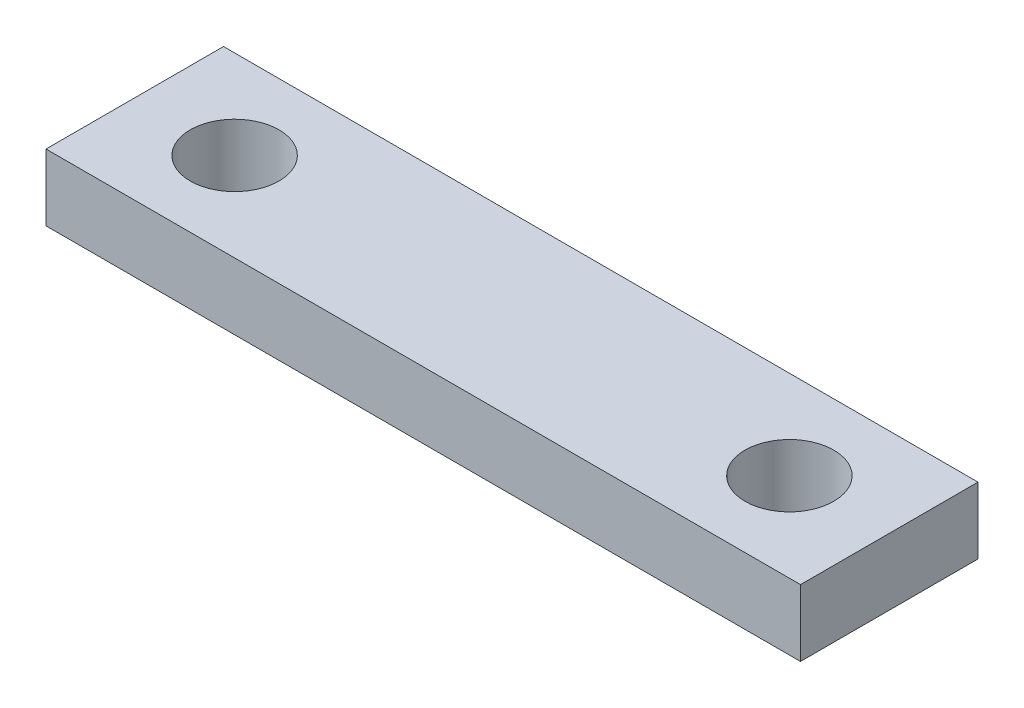
ISO-10303-21;
HEADER;
FILE_DESCRIPTION(('STEP AP214'),'2;1');
FILE_NAME('part.step','',(''),(''),'','','');
FILE_SCHEMA(('AUTOMOTIVE_DESIGN { 1 0 10303 214 1 1 1 1 }'));
ENDSEC;
DATA;
#1=APPLICATION_CONTEXT('core data for automotive mechanical design processes');
#2=APPLICATION_PROTOCOL_DEFINITION('international standard','automotive_design',2000,#1);
#3=PRODUCT_CONTEXT('',#1,'mechanical');
#4=PRODUCT('Part','Part','',(#3));
#5=PRODUCT_RELATED_PRODUCT_CATEGORY('part','',(#4));
#6=PRODUCT_DEFINITION_FORMATION('','',#4);
#7=PRODUCT_DEFINITION_CONTEXT('part definition',#1,'design');
#8=PRODUCT_DEFINITION('design','',#6,#7);
#9=PRODUCT_DEFINITION_SHAPE('','',#8);
#10=(LENGTH_UNIT() NAMED_UNIT(*) SI_UNIT(.MILLI.,.METRE.));
#11=(NAMED_UNIT(*) PLANE_ANGLE_UNIT() SI_UNIT($,.RADIAN.));
#12=(NAMED_UNIT(*) SI_UNIT($,.STERADIAN.) SOLID_ANGLE_UNIT());
#13=UNCERTAINTY_MEASURE_WITH_UNIT(LENGTH_MEASURE(1.E-05),#10,'distance_accuracy_value','');
#14=(GEOMETRIC_REPRESENTATION_CONTEXT(3) GLOBAL_UNCERTAINTY_ASSIGNED_CONTEXT((#13)) GLOBAL_UNIT_ASSIGNED_CONTEXT((#10,
#11,#12)) REPRESENTATION_CONTEXT('',''));
#15=CARTESIAN_POINT('',(0.,0.,0.));
#16=DIRECTION('',(0.,0.,1.));
#17=DIRECTION('',(1.,0.,0.));
#18=AXIS2_PLACEMENT_3D('',#15,#16,#17);
#19=CARTESIAN_POINT('',(0.,3.,0.));
#20=DIRECTION('',(0.,-1.,0.));
#21=DIRECTION('',(0.,0.,-1.));
#22=AXIS2_PLACEMENT_3D('',#19,#20,#21);
#23=PLANE('',#22);
#24=DIRECTION('',(0.,0.,-1.));
#25=VECTOR('',#24,1.);
#26=CARTESIAN_POINT('',(17.,3.,4.));
#27=LINE('',#26,#25);
#28=CARTESIAN_POINT('',(17.,3.,4.));
#29=VERTEX_POINT('',#28);
#30=CARTESIAN_POINT('',(17.,3.,-4.));
#31=VERTEX_POINT('',#30);
#32=EDGE_CURVE('E89',#29,#31,#27,.T.);
#33=ORIENTED_EDGE('',*,*,#32,.T.);
#34=DIRECTION('',(-1.,0.,0.));
#35=VECTOR('',#34,1.);
#36=CARTESIAN_POINT('',(-17.,3.,-4.));
#37=LINE('',#36,#35);
#38=CARTESIAN_POINT('',(-17.,3.,-4.));
#39=VERTEX_POINT('',#38);
#40=EDGE_CURVE('E84',#31,#39,#37,.T.);
#41=ORIENTED_EDGE('',*,*,#40,.T.);
#42=DIRECTION('',(0.,0.,1.));
#43=VECTOR('',#42,1.);
#44=CARTESIAN_POINT('',(-17.,3.,4.));
#45=LINE('',#44,#43);
#46=CARTESIAN_POINT('',(-17.,3.,4.));
#47=VERTEX_POINT('',#46);
#48=EDGE_CURVE('E87',#39,#47,#45,.T.);
#49=ORIENTED_EDGE('',*,*,#48,.T.);
#50=DIRECTION('',(1.,0.,0.));
#51=VECTOR('',#50,1.);
#52=CARTESIAN_POINT('',(-17.,3.,4.));
#53=LINE('',#52,#51);
#54=EDGE_CURVE('E54',#47,#29,#53,.T.);
#55=ORIENTED_EDGE('',*,*,#54,.T.);
#56=EDGE_LOOP('',(#33,#41,#49,#55));
#57=FACE_BOUND('',#56,.T.);
#58=CARTESIAN_POINT('',(-12.5,3.,0.));
#59=DIRECTION('',(0.,1.,0.));
#60=DIRECTION('',(0.,0.,1.));
#61=AXIS2_PLACEMENT_3D('',#58,#59,#60);
#62=CIRCLE('',#61,2.);
#63=CARTESIAN_POINT('',(-12.5,3.,2.));
#64=VERTEX_POINT('',#63);
#65=EDGE_CURVE('E110',#64,#64,#62,.T.);
#66=ORIENTED_EDGE('',*,*,#65,.F.);
#67=EDGE_LOOP('',(#66));
#68=FACE_BOUND('',#67,.T.);
#69=CARTESIAN_POINT('',(12.5,3.,0.));
#70=DIRECTION('',(0.,1.,0.));
#71=DIRECTION('',(0.,0.,1.));
#72=AXIS2_PLACEMENT_3D('',#69,#70,#71);
#73=CIRCLE('',#72,2.);
#74=CARTESIAN_POINT('',(12.5,3.,1.99999999999999));
#75=VERTEX_POINT('',#74);
#76=EDGE_CURVE('E134',#75,#75,#73,.T.);
#77=ORIENTED_EDGE('',*,*,#76,.F.);
#78=EDGE_LOOP('',(#77));
#79=FACE_BOUND('',#78,.T.);
#80=ADVANCED_FACE('F36',(#57,#68,#79),#23,.F.);
#81=CARTESIAN_POINT('',(0.,0.,0.));
#82=DIRECTION('',(0.,-1.,0.));
#83=DIRECTION('',(0.,0.,-1.));
#84=AXIS2_PLACEMENT_3D('',#81,#82,#83);
#85=PLANE('',#84);
#86=CARTESIAN_POINT('',(-12.5,0.,0.));
#87=DIRECTION('',(0.,1.,0.));
#88=DIRECTION('',(0.,0.,1.));
#89=AXIS2_PLACEMENT_3D('',#86,#87,#88);
#90=CIRCLE('',#89,2.);
#91=CARTESIAN_POINT('',(-12.5,0.,2.));
#92=VERTEX_POINT('',#91);
#93=EDGE_CURVE('E130',#92,#92,#90,.T.);
#94=ORIENTED_EDGE('',*,*,#93,.T.);
#95=EDGE_LOOP('',(#94));
#96=FACE_BOUND('',#95,.T.);
#97=DIRECTION('',(0.,0.,-1.));
#98=VECTOR('',#97,1.);
#99=CARTESIAN_POINT('',(17.,0.,4.));
#100=LINE('',#99,#98);
#101=CARTESIAN_POINT('',(17.,0.,4.));
#102=VERTEX_POINT('',#101);
#103=CARTESIAN_POINT('',(17.,0.,-4.));
#104=VERTEX_POINT('',#103);
#105=EDGE_CURVE('E106',#102,#104,#100,.T.);
#106=ORIENTED_EDGE('',*,*,#105,.F.);
#107=DIRECTION('',(1.,0.,0.));
#108=VECTOR('',#107,1.);
#109=CARTESIAN_POINT('',(-17.,0.,4.));
#110=LINE('',#109,#108);
#111=CARTESIAN_POINT('',(-17.,0.,4.));
#112=VERTEX_POINT('',#111);
#113=EDGE_CURVE('E77',#112,#102,#110,.T.);
#114=ORIENTED_EDGE('',*,*,#113,.F.);
#115=DIRECTION('',(0.,0.,1.));
#116=VECTOR('',#115,1.);
#117=CARTESIAN_POINT('',(-17.,0.,4.));
#118=LINE('',#117,#116);
#119=CARTESIAN_POINT('',(-17.,0.,-4.));
#120=VERTEX_POINT('',#119);
#121=EDGE_CURVE('E71',#120,#112,#118,.T.);
#122=ORIENTED_EDGE('',*,*,#121,.F.);
#123=DIRECTION('',(-1.,0.,0.));
#124=VECTOR('',#123,1.);
#125=CARTESIAN_POINT('',(-17.,0.,-4.));
#126=LINE('',#125,#124);
#127=EDGE_CURVE('E94',#104,#120,#126,.T.);
#128=ORIENTED_EDGE('',*,*,#127,.F.);
#129=EDGE_LOOP('',(#106,#114,#122,#128));
#130=FACE_BOUND('',#129,.T.);
#131=CARTESIAN_POINT('',(12.5,0.,0.));
#132=DIRECTION('',(0.,1.,0.));
#133=DIRECTION('',(0.,0.,1.));
#134=AXIS2_PLACEMENT_3D('',#131,#132,#133);
#135=CIRCLE('',#134,2.);
#136=CARTESIAN_POINT('',(12.5,0.,1.99999999999999));
#137=VERTEX_POINT('',#136);
#138=EDGE_CURVE('E138',#137,#137,#135,.T.);
#139=ORIENTED_EDGE('',*,*,#138,.T.);
#140=EDGE_LOOP('',(#139));
#141=FACE_BOUND('',#140,.T.);
#142=ADVANCED_FACE('F124',(#96,#130,#141),#85,.T.);
#143=CARTESIAN_POINT('',(17.,3.,4.));
#144=DIRECTION('',(-1.,0.,0.));
#145=DIRECTION('',(0.,0.,1.));
#146=AXIS2_PLACEMENT_3D('',#143,#144,#145);
#147=PLANE('',#146);
#148=ORIENTED_EDGE('',*,*,#105,.T.);
#149=DIRECTION('',(0.,-1.,0.));
#150=VECTOR('',#149,1.);
#151=CARTESIAN_POINT('',(17.,3.,-4.));
#152=LINE('',#151,#150);
#153=EDGE_CURVE('E11',#31,#104,#152,.T.);
#154=ORIENTED_EDGE('',*,*,#153,.F.);
#155=ORIENTED_EDGE('',*,*,#32,.F.);
#156=DIRECTION('',(0.,-1.,0.));
#157=VECTOR('',#156,1.);
#158=CARTESIAN_POINT('',(17.,3.,4.));
#159=LINE('',#158,#157);
#160=EDGE_CURVE('E102',#29,#102,#159,.T.);
#161=ORIENTED_EDGE('',*,*,#160,.T.);
#162=EDGE_LOOP('',(#148,#154,#155,#161));
#163=FACE_BOUND('',#162,.T.);
#164=ADVANCED_FACE('F38',(#163),#147,.F.);
#165=CARTESIAN_POINT('',(-17.,3.,-4.));
#166=DIRECTION('',(0.,0.,1.));
#167=DIRECTION('',(1.,0.,0.));
#168=AXIS2_PLACEMENT_3D('',#165,#166,#167);
#169=PLANE('',#168);
#170=ORIENTED_EDGE('',*,*,#127,.T.);
#171=DIRECTION('',(0.,-1.,0.));
#172=VECTOR('',#171,1.);
#173=CARTESIAN_POINT('',(-17.,3.,-4.));
#174=LINE('',#173,#172);
#175=EDGE_CURVE('E46',#39,#120,#174,.T.);
#176=ORIENTED_EDGE('',*,*,#175,.F.);
#177=ORIENTED_EDGE('',*,*,#40,.F.);
#178=ORIENTED_EDGE('',*,*,#153,.T.);
#179=EDGE_LOOP('',(#170,#176,#177,#178));
#180=FACE_BOUND('',#179,.T.);
#181=ADVANCED_FACE('F93',(#180),#169,.F.);
#182=CARTESIAN_POINT('',(-17.,3.,4.));
#183=DIRECTION('',(1.,0.,0.));
#184=DIRECTION('',(0.,0.,-1.));
#185=AXIS2_PLACEMENT_3D('',#182,#183,#184);
#186=PLANE('',#185);
#187=ORIENTED_EDGE('',*,*,#121,.T.);
#188=DIRECTION('',(0.,-1.,0.));
#189=VECTOR('',#188,1.);
#190=CARTESIAN_POINT('',(-17.,3.,4.));
#191=LINE('',#190,#189);
#192=EDGE_CURVE('E96',#47,#112,#191,.T.);
#193=ORIENTED_EDGE('',*,*,#192,.F.);
#194=ORIENTED_EDGE('',*,*,#48,.F.);
#195=ORIENTED_EDGE('',*,*,#175,.T.);
#196=EDGE_LOOP('',(#187,#193,#194,#195));
#197=FACE_BOUND('',#196,.T.);
#198=ADVANCED_FACE('F97',(#197),#186,.F.);
#199=CARTESIAN_POINT('',(-17.,3.,4.));
#200=DIRECTION('',(0.,0.,-1.));
#201=DIRECTION('',(-1.,0.,0.));
#202=AXIS2_PLACEMENT_3D('',#199,#200,#201);
#203=PLANE('',#202);
#204=ORIENTED_EDGE('',*,*,#113,.T.);
#205=ORIENTED_EDGE('',*,*,#160,.F.);
#206=ORIENTED_EDGE('',*,*,#54,.F.);
#207=ORIENTED_EDGE('',*,*,#192,.T.);
#208=EDGE_LOOP('',(#204,#205,#206,#207));
#209=FACE_BOUND('',#208,.T.);
#210=ADVANCED_FACE('F121',(#209),#203,.F.);
#211=CARTESIAN_POINT('',(-12.5,3.,0.));
#212=DIRECTION('',(0.,-1.,0.));
#213=DIRECTION('',(0.,0.,-1.));
#214=AXIS2_PLACEMENT_3D('',#211,#212,#213);
#215=CYLINDRICAL_SURFACE('',#214,2.);
#216=ORIENTED_EDGE('',*,*,#65,.T.);
#217=EDGE_LOOP('',(#216));
#218=FACE_BOUND('',#217,.T.);
#219=ORIENTED_EDGE('',*,*,#93,.F.);
#220=EDGE_LOOP('',(#219));
#221=FACE_BOUND('',#220,.T.);
#222=ADVANCED_FACE('F158',(#218,#221),#215,.F.);
#223=CARTESIAN_POINT('',(12.5,3.,0.));
#224=DIRECTION('',(0.,-1.,0.));
#225=DIRECTION('',(0.,0.,-1.));
#226=AXIS2_PLACEMENT_3D('',#223,#224,#225);
#227=CYLINDRICAL_SURFACE('',#226,2.);
#228=ORIENTED_EDGE('',*,*,#76,.T.);
#229=EDGE_LOOP('',(#228));
#230=FACE_BOUND('',#229,.T.);
#231=ORIENTED_EDGE('',*,*,#138,.F.);
#232=EDGE_LOOP('',(#231));
#233=FACE_BOUND('',#232,.T.);
#234=ADVANCED_FACE('F147',(#230,#233),#227,.F.);
#235=CLOSED_SHELL('',(#80,#142,#164,#181,#198,#210,#222,#234));
#236=MANIFOLD_SOLID_BREP('B2',#235);
#237=ADVANCED_BREP_SHAPE_REPRESENTATION('',(#18,#236),#14);
#238=SHAPE_DEFINITION_REPRESENTATION(#9,#237);
ENDSEC;
END-ISO-10303-21;
